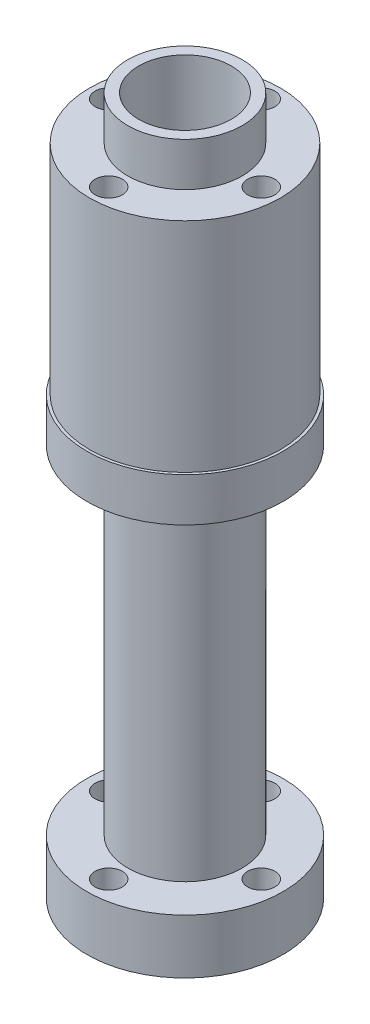
ISO-10303-21;
HEADER;
FILE_DESCRIPTION(('STEP AP214'),'2;1');
FILE_NAME('part.step','',(''),(''),'','','');
FILE_SCHEMA(('AUTOMOTIVE_DESIGN { 1 0 10303 214 1 1 1 1 }'));
ENDSEC;
DATA;
#1=APPLICATION_CONTEXT('core data for automotive mechanical design processes');
#2=APPLICATION_PROTOCOL_DEFINITION('international standard','automotive_design',2000,#1);
#3=PRODUCT_CONTEXT('',#1,'mechanical');
#4=PRODUCT('Part','Part','',(#3));
#5=PRODUCT_RELATED_PRODUCT_CATEGORY('part','',(#4));
#6=PRODUCT_DEFINITION_FORMATION('','',#4);
#7=PRODUCT_DEFINITION_CONTEXT('part definition',#1,'design');
#8=PRODUCT_DEFINITION('design','',#6,#7);
#9=PRODUCT_DEFINITION_SHAPE('','',#8);
#10=(LENGTH_UNIT() NAMED_UNIT(*) SI_UNIT(.MILLI.,.METRE.));
#11=(NAMED_UNIT(*) PLANE_ANGLE_UNIT() SI_UNIT($,.RADIAN.));
#12=(NAMED_UNIT(*) SI_UNIT($,.STERADIAN.) SOLID_ANGLE_UNIT());
#13=UNCERTAINTY_MEASURE_WITH_UNIT(LENGTH_MEASURE(1.E-05),#10,'distance_accuracy_value','');
#14=(GEOMETRIC_REPRESENTATION_CONTEXT(3) GLOBAL_UNCERTAINTY_ASSIGNED_CONTEXT((#13)) GLOBAL_UNIT_ASSIGNED_CONTEXT((#10,
#11,#12)) REPRESENTATION_CONTEXT('',''));
#15=CARTESIAN_POINT('',(0.,0.,0.));
#16=DIRECTION('',(0.,0.,1.));
#17=DIRECTION('',(1.,0.,0.));
#18=AXIS2_PLACEMENT_3D('',#15,#16,#17);
#19=CARTESIAN_POINT('',(-4.25,60.,0.));
#20=DIRECTION('',(0.,-1.,0.));
#21=DIRECTION('',(0.,0.,-1.));
#22=AXIS2_PLACEMENT_3D('',#19,#20,#21);
#23=PLANE('',#22);
#24=CARTESIAN_POINT('',(0.,60.,0.));
#25=DIRECTION('',(0.,1.,0.));
#26=DIRECTION('',(0.,0.,1.));
#27=AXIS2_PLACEMENT_3D('',#24,#25,#26);
#28=CIRCLE('',#27,8.75);
#29=CARTESIAN_POINT('',(0.,60.,8.75));
#30=VERTEX_POINT('',#29);
#31=EDGE_CURVE('E66',#30,#30,#28,.T.);
#32=ORIENTED_EDGE('',*,*,#31,.T.);
#33=EDGE_LOOP('',(#32));
#34=FACE_BOUND('',#33,.T.);
#35=CARTESIAN_POINT('',(0.,60.,-7.));
#36=DIRECTION('',(0.,1.,0.));
#37=DIRECTION('',(0.,0.,1.));
#38=AXIS2_PLACEMENT_3D('',#35,#36,#37);
#39=CIRCLE('',#38,1.25);
#40=CARTESIAN_POINT('',(0.,60.,-5.75));
#41=VERTEX_POINT('',#40);
#42=EDGE_CURVE('E100',#41,#41,#39,.T.);
#43=ORIENTED_EDGE('',*,*,#42,.F.);
#44=EDGE_LOOP('',(#43));
#45=FACE_BOUND('',#44,.T.);
#46=CARTESIAN_POINT('',(0.,60.,7.));
#47=DIRECTION('',(0.,1.,0.));
#48=DIRECTION('',(0.,0.,1.));
#49=AXIS2_PLACEMENT_3D('',#46,#47,#48);
#50=CIRCLE('',#49,1.25);
#51=CARTESIAN_POINT('',(0.,60.,8.25));
#52=VERTEX_POINT('',#51);
#53=EDGE_CURVE('E106',#52,#52,#50,.T.);
#54=ORIENTED_EDGE('',*,*,#53,.F.);
#55=EDGE_LOOP('',(#54));
#56=FACE_BOUND('',#55,.T.);
#57=CARTESIAN_POINT('',(-7.,60.,0.));
#58=DIRECTION('',(0.,1.,0.));
#59=DIRECTION('',(0.,0.,1.));
#60=AXIS2_PLACEMENT_3D('',#57,#58,#59);
#61=CIRCLE('',#60,1.25);
#62=CARTESIAN_POINT('',(-7.,60.,1.25));
#63=VERTEX_POINT('',#62);
#64=EDGE_CURVE('E112',#63,#63,#61,.T.);
#65=ORIENTED_EDGE('',*,*,#64,.F.);
#66=EDGE_LOOP('',(#65));
#67=FACE_BOUND('',#66,.T.);
#68=CARTESIAN_POINT('',(7.,60.,0.));
#69=DIRECTION('',(0.,1.,0.));
#70=DIRECTION('',(0.,0.,1.));
#71=AXIS2_PLACEMENT_3D('',#68,#69,#70);
#72=CIRCLE('',#71,1.25);
#73=CARTESIAN_POINT('',(7.,60.,1.25));
#74=VERTEX_POINT('',#73);
#75=EDGE_CURVE('E95',#74,#74,#72,.T.);
#76=ORIENTED_EDGE('',*,*,#75,.F.);
#77=EDGE_LOOP('',(#76));
#78=FACE_BOUND('',#77,.T.);
#79=CARTESIAN_POINT('',(0.,60.,0.));
#80=DIRECTION('',(0.,-1.,0.));
#81=DIRECTION('',(0.,0.,-1.));
#82=AXIS2_PLACEMENT_3D('',#79,#80,#81);
#83=CIRCLE('',#82,5.25);
#84=CARTESIAN_POINT('',(0.,60.,-5.25));
#85=VERTEX_POINT('',#84);
#86=EDGE_CURVE('E12',#85,#85,#83,.F.);
#87=ORIENTED_EDGE('',*,*,#86,.F.);
#88=EDGE_LOOP('',(#87));
#89=FACE_BOUND('',#88,.T.);
#90=ADVANCED_FACE('F37',(#34,#45,#56,#67,#78,#89),#23,.F.);
#91=CARTESIAN_POINT('',(0.,0.,0.));
#92=DIRECTION('',(0.,-1.,0.));
#93=DIRECTION('',(0.,0.,-1.));
#94=AXIS2_PLACEMENT_3D('',#91,#92,#93);
#95=CYLINDRICAL_SURFACE('',#94,9.);
#96=CARTESIAN_POINT('',(0.,36.,0.));
#97=DIRECTION('',(0.,-1.,0.));
#98=DIRECTION('',(0.,0.,-1.));
#99=AXIS2_PLACEMENT_3D('',#96,#97,#98);
#100=CIRCLE('',#99,9.);
#101=CARTESIAN_POINT('',(0.,36.,-9.));
#102=VERTEX_POINT('',#101);
#103=EDGE_CURVE('E44',#102,#102,#100,.T.);
#104=ORIENTED_EDGE('',*,*,#103,.F.);
#105=EDGE_LOOP('',(#104));
#106=FACE_BOUND('',#105,.T.);
#107=CARTESIAN_POINT('',(0.,40.,0.));
#108=DIRECTION('',(0.,1.,0.));
#109=DIRECTION('',(0.,0.,1.));
#110=AXIS2_PLACEMENT_3D('',#107,#108,#109);
#111=CIRCLE('',#110,9.);
#112=CARTESIAN_POINT('',(0.,40.,9.));
#113=VERTEX_POINT('',#112);
#114=EDGE_CURVE('E56',#113,#113,#111,.T.);
#115=ORIENTED_EDGE('',*,*,#114,.F.);
#116=EDGE_LOOP('',(#115));
#117=FACE_BOUND('',#116,.T.);
#118=ADVANCED_FACE('F144',(#106,#117),#95,.T.);
#119=CARTESIAN_POINT('',(0.,0.,0.));
#120=DIRECTION('',(0.,-1.,0.));
#121=DIRECTION('',(0.,0.,-1.));
#122=AXIS2_PLACEMENT_3D('',#119,#120,#121);
#123=CYLINDRICAL_SURFACE('',#122,4.25);
#124=CARTESIAN_POINT('',(0.,0.,0.));
#125=DIRECTION('',(0.,-1.,0.));
#126=DIRECTION('',(0.,0.,-1.));
#127=AXIS2_PLACEMENT_3D('',#124,#125,#126);
#128=CIRCLE('',#127,4.25);
#129=CARTESIAN_POINT('',(0.,0.,-4.25));
#130=VERTEX_POINT('',#129);
#131=EDGE_CURVE('E99',#130,#130,#128,.T.);
#132=ORIENTED_EDGE('',*,*,#131,.T.);
#133=EDGE_LOOP('',(#132));
#134=FACE_BOUND('',#133,.T.);
#135=CARTESIAN_POINT('',(0.,64.,0.));
#136=DIRECTION('',(0.,1.,0.));
#137=DIRECTION('',(0.,0.,1.));
#138=AXIS2_PLACEMENT_3D('',#135,#136,#137);
#139=CIRCLE('',#138,4.25);
#140=CARTESIAN_POINT('',(0.,64.,4.25));
#141=VERTEX_POINT('',#140);
#142=EDGE_CURVE('E372',#141,#141,#139,.T.);
#143=ORIENTED_EDGE('',*,*,#142,.T.);
#144=EDGE_LOOP('',(#143));
#145=FACE_BOUND('',#144,.T.);
#146=ADVANCED_FACE('F39',(#134,#145),#123,.F.);
#147=CARTESIAN_POINT('',(-9.,36.,0.));
#148=DIRECTION('',(0.,1.,0.));
#149=DIRECTION('',(0.,0.,1.));
#150=AXIS2_PLACEMENT_3D('',#147,#148,#149);
#151=PLANE('',#150);
#152=CARTESIAN_POINT('',(0.,36.,0.));
#153=DIRECTION('',(0.,-1.,0.));
#154=DIRECTION('',(0.,0.,-1.));
#155=AXIS2_PLACEMENT_3D('',#152,#153,#154);
#156=CIRCLE('',#155,5.25);
#157=CARTESIAN_POINT('',(0.,36.,-5.25));
#158=VERTEX_POINT('',#157);
#159=EDGE_CURVE('E48',#158,#158,#156,.T.);
#160=ORIENTED_EDGE('',*,*,#159,.F.);
#161=EDGE_LOOP('',(#160));
#162=FACE_BOUND('',#161,.T.);
#163=ORIENTED_EDGE('',*,*,#103,.T.);
#164=EDGE_LOOP('',(#163));
#165=FACE_BOUND('',#164,.T.);
#166=ADVANCED_FACE('F135',(#162,#165),#151,.F.);
#167=CARTESIAN_POINT('',(0.,0.,0.));
#168=DIRECTION('',(0.,-1.,0.));
#169=DIRECTION('',(0.,0.,-1.));
#170=AXIS2_PLACEMENT_3D('',#167,#168,#169);
#171=CYLINDRICAL_SURFACE('',#170,5.25);
#172=CARTESIAN_POINT('',(0.,5.,0.));
#173=DIRECTION('',(0.,-1.,0.));
#174=DIRECTION('',(0.,0.,-1.));
#175=AXIS2_PLACEMENT_3D('',#172,#173,#174);
#176=CIRCLE('',#175,5.25);
#177=CARTESIAN_POINT('',(0.,5.,-5.25));
#178=VERTEX_POINT('',#177);
#179=EDGE_CURVE('E53',#178,#178,#176,.T.);
#180=ORIENTED_EDGE('',*,*,#179,.F.);
#181=EDGE_LOOP('',(#180));
#182=FACE_BOUND('',#181,.T.);
#183=ORIENTED_EDGE('',*,*,#159,.T.);
#184=EDGE_LOOP('',(#183));
#185=FACE_BOUND('',#184,.T.);
#186=ADVANCED_FACE('F132',(#182,#185),#171,.T.);
#187=CARTESIAN_POINT('',(-5.25,5.,0.));
#188=DIRECTION('',(0.,-1.,0.));
#189=DIRECTION('',(0.,0.,-1.));
#190=AXIS2_PLACEMENT_3D('',#187,#188,#189);
#191=PLANE('',#190);
#192=CARTESIAN_POINT('',(0.,5.,-7.));
#193=DIRECTION('',(0.,-1.,0.));
#194=DIRECTION('',(0.,0.,-1.));
#195=AXIS2_PLACEMENT_3D('',#192,#193,#194);
#196=CIRCLE('',#195,1.25);
#197=CARTESIAN_POINT('',(0.,5.,-8.25));
#198=VERTEX_POINT('',#197);
#199=EDGE_CURVE('E92',#198,#198,#196,.F.);
#200=ORIENTED_EDGE('',*,*,#199,.F.);
#201=EDGE_LOOP('',(#200));
#202=FACE_BOUND('',#201,.T.);
#203=CARTESIAN_POINT('',(0.,5.,7.));
#204=DIRECTION('',(0.,-1.,0.));
#205=DIRECTION('',(0.,0.,-1.));
#206=AXIS2_PLACEMENT_3D('',#203,#204,#205);
#207=CIRCLE('',#206,1.25);
#208=CARTESIAN_POINT('',(0.,5.,5.75));
#209=VERTEX_POINT('',#208);
#210=EDGE_CURVE('E89',#209,#209,#207,.F.);
#211=ORIENTED_EDGE('',*,*,#210,.F.);
#212=EDGE_LOOP('',(#211));
#213=FACE_BOUND('',#212,.T.);
#214=CARTESIAN_POINT('',(-7.,5.,0.));
#215=DIRECTION('',(0.,-1.,0.));
#216=DIRECTION('',(0.,0.,-1.));
#217=AXIS2_PLACEMENT_3D('',#214,#215,#216);
#218=CIRCLE('',#217,1.25);
#219=CARTESIAN_POINT('',(-7.,5.,-1.25));
#220=VERTEX_POINT('',#219);
#221=EDGE_CURVE('E86',#220,#220,#218,.F.);
#222=ORIENTED_EDGE('',*,*,#221,.F.);
#223=EDGE_LOOP('',(#222));
#224=FACE_BOUND('',#223,.T.);
#225=CARTESIAN_POINT('',(7.,5.,0.));
#226=DIRECTION('',(0.,-1.,0.));
#227=DIRECTION('',(0.,0.,-1.));
#228=AXIS2_PLACEMENT_3D('',#225,#226,#227);
#229=CIRCLE('',#228,1.25);
#230=CARTESIAN_POINT('',(7.,5.,-1.25));
#231=VERTEX_POINT('',#230);
#232=EDGE_CURVE('E78',#231,#231,#229,.F.);
#233=ORIENTED_EDGE('',*,*,#232,.F.);
#234=EDGE_LOOP('',(#233));
#235=FACE_BOUND('',#234,.T.);
#236=CARTESIAN_POINT('',(0.,5.,0.));
#237=DIRECTION('',(0.,-1.,0.));
#238=DIRECTION('',(0.,0.,-1.));
#239=AXIS2_PLACEMENT_3D('',#236,#237,#238);
#240=CIRCLE('',#239,9.);
#241=CARTESIAN_POINT('',(0.,5.,-9.));
#242=VERTEX_POINT('',#241);
#243=EDGE_CURVE('E125',#242,#242,#240,.T.);
#244=ORIENTED_EDGE('',*,*,#243,.F.);
#245=EDGE_LOOP('',(#244));
#246=FACE_BOUND('',#245,.T.);
#247=ORIENTED_EDGE('',*,*,#179,.T.);
#248=EDGE_LOOP('',(#247));
#249=FACE_BOUND('',#248,.T.);
#250=ADVANCED_FACE('F130',(#202,#213,#224,#235,#246,#249),#191,.F.);
#251=CARTESIAN_POINT('',(0.,0.,0.));
#252=DIRECTION('',(0.,-1.,0.));
#253=DIRECTION('',(0.,0.,-1.));
#254=AXIS2_PLACEMENT_3D('',#251,#252,#253);
#255=CYLINDRICAL_SURFACE('',#254,9.);
#256=CARTESIAN_POINT('',(0.,0.,0.));
#257=DIRECTION('',(0.,-1.,0.));
#258=DIRECTION('',(0.,0.,-1.));
#259=AXIS2_PLACEMENT_3D('',#256,#257,#258);
#260=CIRCLE('',#259,9.);
#261=CARTESIAN_POINT('',(0.,0.,-9.));
#262=VERTEX_POINT('',#261);
#263=EDGE_CURVE('E122',#262,#262,#260,.T.);
#264=ORIENTED_EDGE('',*,*,#263,.F.);
#265=EDGE_LOOP('',(#264));
#266=FACE_BOUND('',#265,.T.);
#267=ORIENTED_EDGE('',*,*,#243,.T.);
#268=EDGE_LOOP('',(#267));
#269=FACE_BOUND('',#268,.T.);
#270=ADVANCED_FACE('F177',(#266,#269),#255,.T.);
#271=CARTESIAN_POINT('',(-4.25,0.,0.));
#272=DIRECTION('',(0.,1.,0.));
#273=DIRECTION('',(0.,0.,1.));
#274=AXIS2_PLACEMENT_3D('',#271,#272,#273);
#275=PLANE('',#274);
#276=CARTESIAN_POINT('',(0.,0.,-7.));
#277=DIRECTION('',(0.,1.,0.));
#278=DIRECTION('',(0.,0.,1.));
#279=AXIS2_PLACEMENT_3D('',#276,#277,#278);
#280=CIRCLE('',#279,1.25);
#281=CARTESIAN_POINT('',(0.,0.,-5.75));
#282=VERTEX_POINT('',#281);
#283=EDGE_CURVE('E75',#282,#282,#280,.T.);
#284=ORIENTED_EDGE('',*,*,#283,.T.);
#285=EDGE_LOOP('',(#284));
#286=FACE_BOUND('',#285,.T.);
#287=CARTESIAN_POINT('',(0.,0.,7.));
#288=DIRECTION('',(0.,1.,0.));
#289=DIRECTION('',(0.,0.,1.));
#290=AXIS2_PLACEMENT_3D('',#287,#288,#289);
#291=CIRCLE('',#290,1.25);
#292=CARTESIAN_POINT('',(0.,0.,8.25));
#293=VERTEX_POINT('',#292);
#294=EDGE_CURVE('E79',#293,#293,#291,.T.);
#295=ORIENTED_EDGE('',*,*,#294,.T.);
#296=EDGE_LOOP('',(#295));
#297=FACE_BOUND('',#296,.T.);
#298=CARTESIAN_POINT('',(-7.,0.,0.));
#299=DIRECTION('',(0.,1.,0.));
#300=DIRECTION('',(0.,0.,1.));
#301=AXIS2_PLACEMENT_3D('',#298,#299,#300);
#302=CIRCLE('',#301,1.25);
#303=CARTESIAN_POINT('',(-7.,0.,1.25));
#304=VERTEX_POINT('',#303);
#305=EDGE_CURVE('E63',#304,#304,#302,.T.);
#306=ORIENTED_EDGE('',*,*,#305,.T.);
#307=EDGE_LOOP('',(#306));
#308=FACE_BOUND('',#307,.T.);
#309=CARTESIAN_POINT('',(7.,0.,0.));
#310=DIRECTION('',(0.,1.,0.));
#311=DIRECTION('',(0.,0.,1.));
#312=AXIS2_PLACEMENT_3D('',#309,#310,#311);
#313=CIRCLE('',#312,1.25);
#314=CARTESIAN_POINT('',(7.,0.,1.25));
#315=VERTEX_POINT('',#314);
#316=EDGE_CURVE('E58',#315,#315,#313,.T.);
#317=ORIENTED_EDGE('',*,*,#316,.T.);
#318=EDGE_LOOP('',(#317));
#319=FACE_BOUND('',#318,.T.);
#320=ORIENTED_EDGE('',*,*,#131,.F.);
#321=EDGE_LOOP('',(#320));
#322=FACE_BOUND('',#321,.T.);
#323=ORIENTED_EDGE('',*,*,#263,.T.);
#324=EDGE_LOOP('',(#323));
#325=FACE_BOUND('',#324,.T.);
#326=ADVANCED_FACE('F167',(#286,#297,#308,#319,#322,#325),#275,.F.);
#327=CARTESIAN_POINT('',(7.,50.,0.));
#328=DIRECTION('',(0.,1.,0.));
#329=DIRECTION('',(0.,0.,1.));
#330=AXIS2_PLACEMENT_3D('',#327,#328,#329);
#331=CYLINDRICAL_SURFACE('',#330,1.25);
#332=CARTESIAN_POINT('',(7.,50.,0.));
#333=DIRECTION('',(0.,1.,0.));
#334=DIRECTION('',(0.,0.,1.));
#335=AXIS2_PLACEMENT_3D('',#332,#333,#334);
#336=CIRCLE('',#335,1.25);
#337=CARTESIAN_POINT('',(7.,50.,1.25));
#338=VERTEX_POINT('',#337);
#339=EDGE_CURVE('E115',#338,#338,#336,.T.);
#340=ORIENTED_EDGE('',*,*,#339,.F.);
#341=EDGE_LOOP('',(#340));
#342=FACE_BOUND('',#341,.T.);
#343=ORIENTED_EDGE('',*,*,#75,.T.);
#344=EDGE_LOOP('',(#343));
#345=FACE_BOUND('',#344,.T.);
#346=ADVANCED_FACE('F164',(#342,#345),#331,.F.);
#347=CARTESIAN_POINT('',(7.,50.,0.));
#348=DIRECTION('',(0.,1.,0.));
#349=DIRECTION('',(0.,0.,1.));
#350=AXIS2_PLACEMENT_3D('',#347,#348,#349);
#351=PLANE('',#350);
#352=ORIENTED_EDGE('',*,*,#339,.T.);
#353=EDGE_LOOP('',(#352));
#354=FACE_BOUND('',#353,.T.);
#355=ADVANCED_FACE('F166',(#354),#351,.T.);
#356=CARTESIAN_POINT('',(-7.,50.,0.));
#357=DIRECTION('',(0.,1.,0.));
#358=DIRECTION('',(0.,0.,1.));
#359=AXIS2_PLACEMENT_3D('',#356,#357,#358);
#360=CYLINDRICAL_SURFACE('',#359,1.25);
#361=CARTESIAN_POINT('',(-7.,50.,0.));
#362=DIRECTION('',(0.,1.,0.));
#363=DIRECTION('',(0.,0.,1.));
#364=AXIS2_PLACEMENT_3D('',#361,#362,#363);
#365=CIRCLE('',#364,1.25);
#366=CARTESIAN_POINT('',(-7.,50.,1.25));
#367=VERTEX_POINT('',#366);
#368=EDGE_CURVE('E109',#367,#367,#365,.T.);
#369=ORIENTED_EDGE('',*,*,#368,.F.);
#370=EDGE_LOOP('',(#369));
#371=FACE_BOUND('',#370,.T.);
#372=ORIENTED_EDGE('',*,*,#64,.T.);
#373=EDGE_LOOP('',(#372));
#374=FACE_BOUND('',#373,.T.);
#375=ADVANCED_FACE('F174',(#371,#374),#360,.F.);
#376=CARTESIAN_POINT('',(-7.,50.,0.));
#377=DIRECTION('',(0.,1.,0.));
#378=DIRECTION('',(0.,0.,1.));
#379=AXIS2_PLACEMENT_3D('',#376,#377,#378);
#380=PLANE('',#379);
#381=ORIENTED_EDGE('',*,*,#368,.T.);
#382=EDGE_LOOP('',(#381));
#383=FACE_BOUND('',#382,.T.);
#384=ADVANCED_FACE('F230',(#383),#380,.T.);
#385=CARTESIAN_POINT('',(0.,50.,7.));
#386=DIRECTION('',(0.,1.,0.));
#387=DIRECTION('',(0.,0.,1.));
#388=AXIS2_PLACEMENT_3D('',#385,#386,#387);
#389=CYLINDRICAL_SURFACE('',#388,1.25);
#390=CARTESIAN_POINT('',(0.,50.,7.));
#391=DIRECTION('',(0.,1.,0.));
#392=DIRECTION('',(0.,0.,1.));
#393=AXIS2_PLACEMENT_3D('',#390,#391,#392);
#394=CIRCLE('',#393,1.25);
#395=CARTESIAN_POINT('',(0.,50.,8.25));
#396=VERTEX_POINT('',#395);
#397=EDGE_CURVE('E103',#396,#396,#394,.T.);
#398=ORIENTED_EDGE('',*,*,#397,.F.);
#399=EDGE_LOOP('',(#398));
#400=FACE_BOUND('',#399,.T.);
#401=ORIENTED_EDGE('',*,*,#53,.T.);
#402=EDGE_LOOP('',(#401));
#403=FACE_BOUND('',#402,.T.);
#404=ADVANCED_FACE('F226',(#400,#403),#389,.F.);
#405=CARTESIAN_POINT('',(0.,50.,7.));
#406=DIRECTION('',(0.,1.,0.));
#407=DIRECTION('',(0.,0.,1.));
#408=AXIS2_PLACEMENT_3D('',#405,#406,#407);
#409=PLANE('',#408);
#410=ORIENTED_EDGE('',*,*,#397,.T.);
#411=EDGE_LOOP('',(#410));
#412=FACE_BOUND('',#411,.T.);
#413=ADVANCED_FACE('F222',(#412),#409,.T.);
#414=CARTESIAN_POINT('',(0.,50.,-7.));
#415=DIRECTION('',(0.,1.,0.));
#416=DIRECTION('',(0.,0.,1.));
#417=AXIS2_PLACEMENT_3D('',#414,#415,#416);
#418=CYLINDRICAL_SURFACE('',#417,1.25);
#419=CARTESIAN_POINT('',(0.,50.,-7.));
#420=DIRECTION('',(0.,1.,0.));
#421=DIRECTION('',(0.,0.,1.));
#422=AXIS2_PLACEMENT_3D('',#419,#420,#421);
#423=CIRCLE('',#422,1.25);
#424=CARTESIAN_POINT('',(0.,50.,-5.75));
#425=VERTEX_POINT('',#424);
#426=EDGE_CURVE('E96',#425,#425,#423,.T.);
#427=ORIENTED_EDGE('',*,*,#426,.F.);
#428=EDGE_LOOP('',(#427));
#429=FACE_BOUND('',#428,.T.);
#430=ORIENTED_EDGE('',*,*,#42,.T.);
#431=EDGE_LOOP('',(#430));
#432=FACE_BOUND('',#431,.T.);
#433=ADVANCED_FACE('F214',(#429,#432),#418,.F.);
#434=CARTESIAN_POINT('',(0.,50.,-7.));
#435=DIRECTION('',(0.,1.,0.));
#436=DIRECTION('',(0.,0.,1.));
#437=AXIS2_PLACEMENT_3D('',#434,#435,#436);
#438=PLANE('',#437);
#439=ORIENTED_EDGE('',*,*,#426,.T.);
#440=EDGE_LOOP('',(#439));
#441=FACE_BOUND('',#440,.T.);
#442=ADVANCED_FACE('F204',(#441),#438,.T.);
#443=CARTESIAN_POINT('',(7.,6.,0.));
#444=DIRECTION('',(0.,-1.,0.));
#445=DIRECTION('',(0.,0.,-1.));
#446=AXIS2_PLACEMENT_3D('',#443,#444,#445);
#447=CYLINDRICAL_SURFACE('',#446,1.25);
#448=ORIENTED_EDGE('',*,*,#316,.F.);
#449=EDGE_LOOP('',(#448));
#450=FACE_BOUND('',#449,.T.);
#451=ORIENTED_EDGE('',*,*,#232,.T.);
#452=EDGE_LOOP('',(#451));
#453=FACE_BOUND('',#452,.T.);
#454=ADVANCED_FACE('F201',(#450,#453),#447,.F.);
#455=CARTESIAN_POINT('',(-7.,6.,0.));
#456=DIRECTION('',(0.,-1.,0.));
#457=DIRECTION('',(0.,0.,-1.));
#458=AXIS2_PLACEMENT_3D('',#455,#456,#457);
#459=CYLINDRICAL_SURFACE('',#458,1.25);
#460=ORIENTED_EDGE('',*,*,#305,.F.);
#461=EDGE_LOOP('',(#460));
#462=FACE_BOUND('',#461,.T.);
#463=ORIENTED_EDGE('',*,*,#221,.T.);
#464=EDGE_LOOP('',(#463));
#465=FACE_BOUND('',#464,.T.);
#466=ADVANCED_FACE('F203',(#462,#465),#459,.F.);
#467=CARTESIAN_POINT('',(0.,6.,7.));
#468=DIRECTION('',(0.,-1.,0.));
#469=DIRECTION('',(0.,0.,-1.));
#470=AXIS2_PLACEMENT_3D('',#467,#468,#469);
#471=CYLINDRICAL_SURFACE('',#470,1.25);
#472=ORIENTED_EDGE('',*,*,#294,.F.);
#473=EDGE_LOOP('',(#472));
#474=FACE_BOUND('',#473,.T.);
#475=ORIENTED_EDGE('',*,*,#210,.T.);
#476=EDGE_LOOP('',(#475));
#477=FACE_BOUND('',#476,.T.);
#478=ADVANCED_FACE('F211',(#474,#477),#471,.F.);
#479=CARTESIAN_POINT('',(0.,6.,-7.));
#480=DIRECTION('',(0.,-1.,0.));
#481=DIRECTION('',(0.,0.,-1.));
#482=AXIS2_PLACEMENT_3D('',#479,#480,#481);
#483=CYLINDRICAL_SURFACE('',#482,1.25);
#484=ORIENTED_EDGE('',*,*,#283,.F.);
#485=EDGE_LOOP('',(#484));
#486=FACE_BOUND('',#485,.T.);
#487=ORIENTED_EDGE('',*,*,#199,.T.);
#488=EDGE_LOOP('',(#487));
#489=FACE_BOUND('',#488,.T.);
#490=ADVANCED_FACE('F300',(#486,#489),#483,.F.);
#491=CARTESIAN_POINT('',(-9.,40.,0.));
#492=DIRECTION('',(0.,1.,0.));
#493=DIRECTION('',(0.,0.,1.));
#494=AXIS2_PLACEMENT_3D('',#491,#492,#493);
#495=PLANE('',#494);
#496=CARTESIAN_POINT('',(0.,40.,0.));
#497=DIRECTION('',(0.,1.,0.));
#498=DIRECTION('',(0.,0.,1.));
#499=AXIS2_PLACEMENT_3D('',#496,#497,#498);
#500=CIRCLE('',#499,8.75);
#501=CARTESIAN_POINT('',(0.,40.,8.75));
#502=VERTEX_POINT('',#501);
#503=EDGE_CURVE('E59',#502,#502,#500,.F.);
#504=ORIENTED_EDGE('',*,*,#503,.T.);
#505=EDGE_LOOP('',(#504));
#506=FACE_BOUND('',#505,.T.);
#507=ORIENTED_EDGE('',*,*,#114,.T.);
#508=EDGE_LOOP('',(#507));
#509=FACE_BOUND('',#508,.T.);
#510=ADVANCED_FACE('F310',(#506,#509),#495,.T.);
#511=CARTESIAN_POINT('',(0.,10.2895974360571,0.));
#512=DIRECTION('',(0.,1.,0.));
#513=DIRECTION('',(0.,0.,1.));
#514=AXIS2_PLACEMENT_3D('',#511,#512,#513);
#515=CYLINDRICAL_SURFACE('',#514,8.75);
#516=CARTESIAN_POINT('',(0.,40.,8.75));
#517=CARTESIAN_POINT('',(0.,40.2083333333333,8.75));
#518=CARTESIAN_POINT('',(0.,40.4166666666667,8.75));
#519=CARTESIAN_POINT('',(0.,40.8333333333333,8.75));
#520=CARTESIAN_POINT('',(0.,41.0416666666667,8.75));
#521=CARTESIAN_POINT('',(0.,41.4583333333333,8.75));
#522=CARTESIAN_POINT('',(0.,41.6666666666667,8.75));
#523=CARTESIAN_POINT('',(0.,42.0833333333333,8.75));
#524=CARTESIAN_POINT('',(0.,42.2916666666667,8.75));
#525=CARTESIAN_POINT('',(0.,42.7083333333333,8.75));
#526=CARTESIAN_POINT('',(0.,42.9166666666667,8.75));
#527=CARTESIAN_POINT('',(0.,43.3333333333333,8.75));
#528=CARTESIAN_POINT('',(0.,43.5416666666667,8.75));
#529=CARTESIAN_POINT('',(0.,43.9583333333333,8.75));
#530=CARTESIAN_POINT('',(0.,44.1666666666667,8.75));
#531=CARTESIAN_POINT('',(0.,44.5833333333333,8.75));
#532=CARTESIAN_POINT('',(0.,44.7916666666667,8.75));
#533=CARTESIAN_POINT('',(0.,45.2083333333333,8.75));
#534=CARTESIAN_POINT('',(0.,45.4166666666667,8.75));
#535=CARTESIAN_POINT('',(0.,45.8333333333333,8.75));
#536=CARTESIAN_POINT('',(0.,46.0416666666667,8.75));
#537=CARTESIAN_POINT('',(0.,46.4583333333333,8.75));
#538=CARTESIAN_POINT('',(0.,46.6666666666667,8.75));
#539=CARTESIAN_POINT('',(0.,47.0833333333333,8.75));
#540=CARTESIAN_POINT('',(0.,47.2916666666667,8.75));
#541=CARTESIAN_POINT('',(0.,47.7083333333333,8.75));
#542=CARTESIAN_POINT('',(0.,47.9166666666667,8.75));
#543=CARTESIAN_POINT('',(0.,48.3333333333333,8.75));
#544=CARTESIAN_POINT('',(0.,48.5416666666667,8.75));
#545=CARTESIAN_POINT('',(0.,48.9583333333333,8.75));
#546=CARTESIAN_POINT('',(0.,49.1666666666667,8.75));
#547=CARTESIAN_POINT('',(0.,49.5833333333333,8.75));
#548=CARTESIAN_POINT('',(0.,49.7916666666667,8.75));
#549=CARTESIAN_POINT('',(0.,50.2083333333333,8.75));
#550=CARTESIAN_POINT('',(0.,50.4166666666667,8.75));
#551=CARTESIAN_POINT('',(0.,50.8333333333333,8.75));
#552=CARTESIAN_POINT('',(0.,51.0416666666667,8.75));
#553=CARTESIAN_POINT('',(0.,51.4583333333333,8.75));
#554=CARTESIAN_POINT('',(0.,51.6666666666667,8.75));
#555=CARTESIAN_POINT('',(0.,52.0833333333333,8.75));
#556=CARTESIAN_POINT('',(0.,52.2916666666667,8.75));
#557=CARTESIAN_POINT('',(0.,52.7083333333333,8.75));
#558=CARTESIAN_POINT('',(0.,52.9166666666667,8.75));
#559=CARTESIAN_POINT('',(0.,53.3333333333333,8.75));
#560=CARTESIAN_POINT('',(0.,53.5416666666667,8.75));
#561=CARTESIAN_POINT('',(0.,53.9583333333333,8.75));
#562=CARTESIAN_POINT('',(0.,54.1666666666667,8.75));
#563=CARTESIAN_POINT('',(0.,54.5833333333333,8.75));
#564=CARTESIAN_POINT('',(0.,54.7916666666667,8.75));
#565=CARTESIAN_POINT('',(0.,55.2083333333333,8.75));
#566=CARTESIAN_POINT('',(0.,55.4166666666667,8.75));
#567=CARTESIAN_POINT('',(0.,55.8333333333333,8.75));
#568=CARTESIAN_POINT('',(0.,56.0416666666667,8.75));
#569=CARTESIAN_POINT('',(0.,56.4583333333333,8.75));
#570=CARTESIAN_POINT('',(0.,56.6666666666667,8.75));
#571=CARTESIAN_POINT('',(0.,57.0833333333333,8.75));
#572=CARTESIAN_POINT('',(0.,57.2916666666667,8.75));
#573=CARTESIAN_POINT('',(0.,57.7083333333333,8.75));
#574=CARTESIAN_POINT('',(0.,57.9166666666667,8.75));
#575=CARTESIAN_POINT('',(0.,58.3333333333333,8.75));
#576=CARTESIAN_POINT('',(0.,58.5416666666667,8.75));
#577=CARTESIAN_POINT('',(0.,58.9583333333333,8.75));
#578=CARTESIAN_POINT('',(0.,59.1666666666667,8.75));
#579=CARTESIAN_POINT('',(0.,59.5833333333333,8.75));
#580=CARTESIAN_POINT('',(0.,59.7916666666667,8.75));
#581=CARTESIAN_POINT('',(0.,60.,8.75));
#582=B_SPLINE_CURVE_WITH_KNOTS('',3,(#516,#517,#518,#519,#520,#521,#522,#523,#524,#525,#526,
#527,#528,#529,#530,#531,#532,#533,#534,#535,#536,#537,#538,#539,#540,#541,#542,#543,#544,#545,
#546,#547,#548,#549,#550,#551,#552,#553,#554,#555,#556,#557,#558,#559,#560,#561,#562,#563,#564,
#565,#566,#567,#568,#569,#570,#571,#572,#573,#574,#575,#576,#577,#578,#579,#580,#581),
.UNSPECIFIED.,.F.,.F.,(4,2,2,2,2,2,2,2,2,2,2,2,2,2,2,2,2,2,2,2,2,2,2,2,2,2,2,2,2,2,2,2,4),(0.,
0.625000000000001,1.25,1.87499999999999,2.5,3.125,3.75,4.375,5.,5.625,6.24999999999999,
6.87499999999999,7.49999999999999,8.12499999999999,8.74999999999999,9.37499999999999,
9.99999999999999,10.625,11.25,11.875,12.5,13.125,13.75,14.375,15.,15.625,16.25,16.875,17.5,
18.125,18.75,19.375,20.),.UNSPECIFIED.);
#583=EDGE_CURVE('BSEAM326',#502,#30,#582,.T.);
#584=ORIENTED_EDGE('',*,*,#503,.F.);
#585=ORIENTED_EDGE('',*,*,#31,.F.);
#586=ORIENTED_EDGE('',*,*,#583,.T.);
#587=ORIENTED_EDGE('',*,*,#583,.F.);
#588=EDGE_LOOP('',(#584,#586,#585,#587));
#589=FACE_BOUND('',#588,.T.);
#590=ADVANCED_FACE('F326',(#589),#515,.T.);
#591=CARTESIAN_POINT('',(0.,64.,0.));
#592=DIRECTION('',(0.,1.,0.));
#593=DIRECTION('',(0.,0.,1.));
#594=AXIS2_PLACEMENT_3D('',#591,#592,#593);
#595=PLANE('',#594);
#596=CARTESIAN_POINT('',(0.,64.,0.));
#597=DIRECTION('',(0.,1.,0.));
#598=DIRECTION('',(0.,0.,1.));
#599=AXIS2_PLACEMENT_3D('',#596,#597,#598);
#600=CIRCLE('',#599,5.25);
#601=CARTESIAN_POINT('',(0.,64.,5.25));
#602=VERTEX_POINT('',#601);
#603=EDGE_CURVE('E71',#602,#602,#600,.T.);
#604=ORIENTED_EDGE('',*,*,#603,.T.);
#605=EDGE_LOOP('',(#604));
#606=FACE_BOUND('',#605,.T.);
#607=ORIENTED_EDGE('',*,*,#142,.F.);
#608=EDGE_LOOP('',(#607));
#609=FACE_BOUND('',#608,.T.);
#610=ADVANCED_FACE('F334',(#606,#609),#595,.T.);
#611=CARTESIAN_POINT('',(0.,64.,0.));
#612=DIRECTION('',(0.,-1.,0.));
#613=DIRECTION('',(0.,0.,-1.));
#614=AXIS2_PLACEMENT_3D('',#611,#612,#613);
#615=CYLINDRICAL_SURFACE('',#614,5.25);
#616=ORIENTED_EDGE('',*,*,#603,.F.);
#617=EDGE_LOOP('',(#616));
#618=FACE_BOUND('',#617,.T.);
#619=ORIENTED_EDGE('',*,*,#86,.T.);
#620=EDGE_LOOP('',(#619));
#621=FACE_BOUND('',#620,.T.);
#622=ADVANCED_FACE('F356',(#618,#621),#615,.T.);
#623=CLOSED_SHELL('',(#90,#118,#146,#166,#186,#250,#270,#326,#346,#355,#375,#384,#404,#413,#433,
#442,#454,#466,#478,#490,#510,#590,#610,#622));
#624=MANIFOLD_SOLID_BREP('B2',#623);
#625=ADVANCED_BREP_SHAPE_REPRESENTATION('',(#18,#624),#14);
#626=SHAPE_DEFINITION_REPRESENTATION(#9,#625);
ENDSEC;
END-ISO-10303-21;
